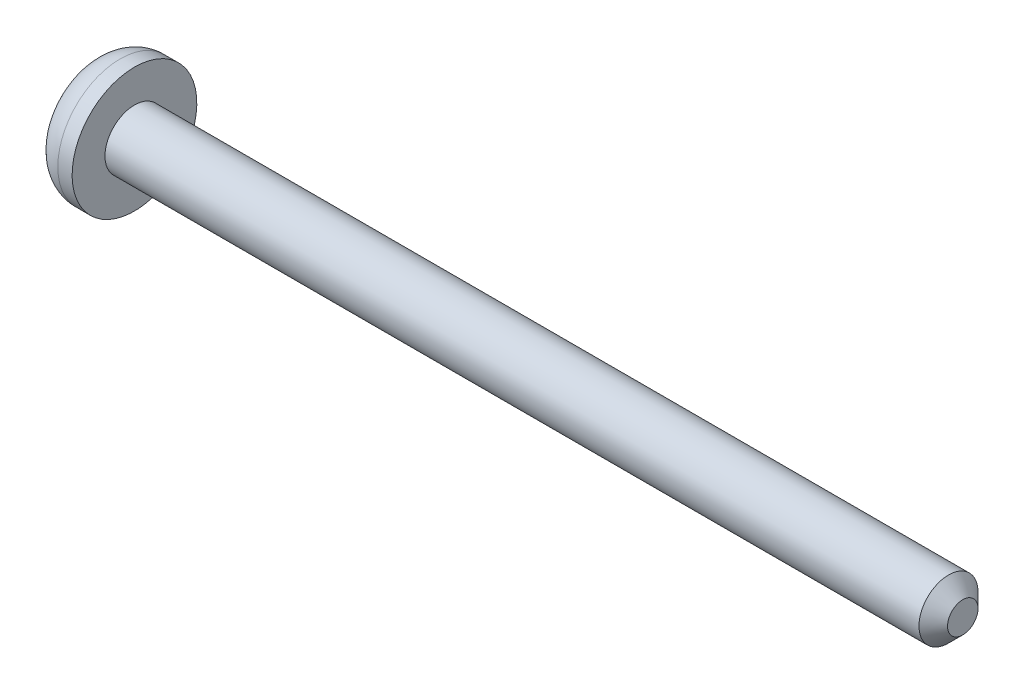
ISO-10303-21;
HEADER;
FILE_DESCRIPTION(('STEP AP214'),'2;1');
FILE_NAME('part.step','',(''),(''),'','','');
FILE_SCHEMA(('AUTOMOTIVE_DESIGN { 1 0 10303 214 1 1 1 1 }'));
ENDSEC;
DATA;
#1=APPLICATION_CONTEXT('core data for automotive mechanical design processes');
#2=APPLICATION_PROTOCOL_DEFINITION('international standard','automotive_design',2000,#1);
#3=PRODUCT_CONTEXT('',#1,'mechanical');
#4=PRODUCT('Part','Part','',(#3));
#5=PRODUCT_RELATED_PRODUCT_CATEGORY('part','',(#4));
#6=PRODUCT_DEFINITION_FORMATION('','',#4);
#7=PRODUCT_DEFINITION_CONTEXT('part definition',#1,'design');
#8=PRODUCT_DEFINITION('design','',#6,#7);
#9=PRODUCT_DEFINITION_SHAPE('','',#8);
#10=(LENGTH_UNIT() NAMED_UNIT(*) SI_UNIT(.MILLI.,.METRE.));
#11=(NAMED_UNIT(*) PLANE_ANGLE_UNIT() SI_UNIT($,.RADIAN.));
#12=(NAMED_UNIT(*) SI_UNIT($,.STERADIAN.) SOLID_ANGLE_UNIT());
#13=UNCERTAINTY_MEASURE_WITH_UNIT(LENGTH_MEASURE(1.E-05),#10,'distance_accuracy_value','');
#14=(GEOMETRIC_REPRESENTATION_CONTEXT(3) GLOBAL_UNCERTAINTY_ASSIGNED_CONTEXT((#13)) GLOBAL_UNIT_ASSIGNED_CONTEXT((#10,
#11,#12)) REPRESENTATION_CONTEXT('',''));
#15=CARTESIAN_POINT('',(0.,0.,0.));
#16=DIRECTION('',(0.,0.,1.));
#17=DIRECTION('',(1.,0.,0.));
#18=AXIS2_PLACEMENT_3D('',#15,#16,#17);
#19=CARTESIAN_POINT('',(-46.482,0.,0.));
#20=DIRECTION('',(-1.,0.,0.));
#21=DIRECTION('',(0.,-0.999999999999997,0.));
#22=AXIS2_PLACEMENT_3D('',#19,#20,#21);
#23=PLANE('',#22);
#24=DIRECTION('',(0.,0.,0.999999999999999));
#25=VECTOR('',#24,1.);
#26=CARTESIAN_POINT('',(-46.482,-0.292769296203976,-0.292769296203851));
#27=LINE('',#26,#25);
#28=CARTESIAN_POINT('',(-46.482,-0.292769296203962,-1.77947680490641));
#29=VERTEX_POINT('',#28);
#30=CARTESIAN_POINT('',(-46.482,-0.292769296203976,-0.292769296203851));
#31=VERTEX_POINT('',#30);
#32=EDGE_CURVE('E206',#29,#31,#27,.T.);
#33=ORIENTED_EDGE('',*,*,#32,.F.);
#34=CARTESIAN_POINT('',(-46.482,0.,0.));
#35=DIRECTION('',(-1.,0.,0.));
#36=DIRECTION('',(0.,-0.999999999999997,0.));
#37=AXIS2_PLACEMENT_3D('',#34,#35,#36);
#38=CIRCLE('',#37,1.8034);
#39=CARTESIAN_POINT('',(-46.482,-1.77947680490662,-0.292769296203838));
#40=VERTEX_POINT('',#39);
#41=EDGE_CURVE('E309',#29,#40,#38,.T.);
#42=ORIENTED_EDGE('',*,*,#41,.T.);
#43=DIRECTION('',(0.,-0.999999999999998,0.));
#44=VECTOR('',#43,1.);
#45=CARTESIAN_POINT('',(-46.482,-2.30304349245305,-0.292769296203851));
#46=LINE('',#45,#44);
#47=EDGE_CURVE('E211',#31,#40,#46,.T.);
#48=ORIENTED_EDGE('',*,*,#47,.F.);
#49=EDGE_LOOP('',(#33,#42,#48));
#50=FACE_BOUND('',#49,.T.);
#51=ADVANCED_FACE('F57',(#50),#23,.T.);
#52=DIRECTION('',(0.,0.999999999999998,0.));
#53=VECTOR('',#52,1.);
#54=CARTESIAN_POINT('',(-46.482,-2.30304349245305,0.292769296203949));
#55=LINE('',#54,#53);
#56=CARTESIAN_POINT('',(-46.482,-1.77947680490658,0.292769296203872));
#57=VERTEX_POINT('',#56);
#58=CARTESIAN_POINT('',(-46.482,-0.292769296203928,0.292769296203865));
#59=VERTEX_POINT('',#58);
#60=EDGE_CURVE('E217',#57,#59,#55,.T.);
#61=ORIENTED_EDGE('',*,*,#60,.F.);
#62=CARTESIAN_POINT('',(-46.482,0.,0.));
#63=DIRECTION('',(-1.,0.,0.));
#64=DIRECTION('',(0.,-0.999999999999997,0.));
#65=AXIS2_PLACEMENT_3D('',#62,#63,#64);
#66=CIRCLE('',#65,1.8034);
#67=CARTESIAN_POINT('',(-46.482,-0.292769296203907,1.77947680490649));
#68=VERTEX_POINT('',#67);
#69=EDGE_CURVE('E306',#57,#68,#66,.T.);
#70=ORIENTED_EDGE('',*,*,#69,.T.);
#71=DIRECTION('',(0.,0.,0.999999999999999));
#72=VECTOR('',#71,1.);
#73=CARTESIAN_POINT('',(-46.482,-0.292769296203949,2.30304349245294));
#74=LINE('',#73,#72);
#75=EDGE_CURVE('E220',#59,#68,#74,.T.);
#76=ORIENTED_EDGE('',*,*,#75,.F.);
#77=EDGE_LOOP('',(#61,#70,#76));
#78=FACE_BOUND('',#77,.T.);
#79=ADVANCED_FACE('F428',(#78),#23,.T.);
#80=DIRECTION('',(0.,0.,-0.999999999999999));
#81=VECTOR('',#80,1.);
#82=CARTESIAN_POINT('',(-46.482,0.292769296203817,2.30304349245301));
#83=LINE('',#82,#81);
#84=CARTESIAN_POINT('',(-46.482,0.292769296203831,1.77947680490659));
#85=VERTEX_POINT('',#84);
#86=CARTESIAN_POINT('',(-46.482,0.292769296203817,0.292769296203851));
#87=VERTEX_POINT('',#86);
#88=EDGE_CURVE('E224',#85,#87,#83,.T.);
#89=ORIENTED_EDGE('',*,*,#88,.F.);
#90=CARTESIAN_POINT('',(-46.482,0.,0.));
#91=DIRECTION('',(-1.,0.,0.));
#92=DIRECTION('',(0.,-0.999999999999997,0.));
#93=AXIS2_PLACEMENT_3D('',#90,#91,#92);
#94=CIRCLE('',#93,1.8034);
#95=CARTESIAN_POINT('',(-46.482,1.77947680490637,0.29276929620399));
#96=VERTEX_POINT('',#95);
#97=EDGE_CURVE('E303',#85,#96,#94,.T.);
#98=ORIENTED_EDGE('',*,*,#97,.T.);
#99=DIRECTION('',(0.,0.999999999999998,0.));
#100=VECTOR('',#99,1.);
#101=CARTESIAN_POINT('',(-46.482,0.292769296203817,0.292769296203851));
#102=LINE('',#101,#100);
#103=EDGE_CURVE('E227',#87,#96,#102,.T.);
#104=ORIENTED_EDGE('',*,*,#103,.F.);
#105=EDGE_LOOP('',(#89,#98,#104));
#106=FACE_BOUND('',#105,.T.);
#107=ADVANCED_FACE('F433',(#106),#23,.T.);
#108=CARTESIAN_POINT('',(0.,0.,0.));
#109=DIRECTION('',(1.,0.,0.));
#110=DIRECTION('',(0.,0.999999999999997,0.));
#111=AXIS2_PLACEMENT_3D('',#108,#109,#110);
#112=PLANE('',#111);
#113=CARTESIAN_POINT('',(0.,0.,0.));
#114=DIRECTION('',(1.,0.,0.));
#115=DIRECTION('',(0.,0.999999999999997,0.));
#116=AXIS2_PLACEMENT_3D('',#113,#114,#115);
#117=CIRCLE('',#116,0.812799999999999);
#118=CARTESIAN_POINT('',(0.,0.812799999999997,0.));
#119=VERTEX_POINT('',#118);
#120=EDGE_CURVE('E293',#119,#119,#117,.T.);
#121=ORIENTED_EDGE('',*,*,#120,.T.);
#122=EDGE_LOOP('',(#121));
#123=FACE_BOUND('',#122,.T.);
#124=ADVANCED_FACE('F444',(#123),#112,.T.);
#125=CARTESIAN_POINT('',(0.,0.,0.));
#126=DIRECTION('',(-1.,0.,0.));
#127=DIRECTION('',(0.,-0.999999999999997,0.));
#128=AXIS2_PLACEMENT_3D('',#125,#126,#127);
#129=CONICAL_SURFACE('',#128,0.812799999999999,0.785398163397449);
#130=CARTESIAN_POINT('',(-0.762000000000013,0.,0.));
#131=DIRECTION('',(1.,0.,0.));
#132=DIRECTION('',(0.,0.999999999999997,0.));
#133=AXIS2_PLACEMENT_3D('',#130,#131,#132);
#134=CIRCLE('',#133,1.5748);
#135=CARTESIAN_POINT('',(-0.762000000000012,1.57479999999995,0.));
#136=VERTEX_POINT('',#135);
#137=EDGE_CURVE('E289',#136,#136,#134,.T.);
#138=ORIENTED_EDGE('',*,*,#137,.T.);
#139=EDGE_LOOP('',(#138));
#140=FACE_BOUND('',#139,.T.);
#141=ORIENTED_EDGE('',*,*,#120,.F.);
#142=EDGE_LOOP('',(#141));
#143=FACE_BOUND('',#142,.T.);
#144=ADVANCED_FACE('F449',(#140,#143),#129,.T.);
#145=CARTESIAN_POINT('',(0.,0.,0.));
#146=DIRECTION('',(1.,0.,0.));
#147=DIRECTION('',(0.,0.999999999999997,0.));
#148=AXIS2_PLACEMENT_3D('',#145,#146,#147);
#149=CYLINDRICAL_SURFACE('',#148,1.5748);
#150=CARTESIAN_POINT('',(-44.196,0.,0.));
#151=DIRECTION('',(1.,0.,0.));
#152=DIRECTION('',(0.,0.999999999999997,0.));
#153=AXIS2_PLACEMENT_3D('',#150,#151,#152);
#154=CIRCLE('',#153,1.5748);
#155=CARTESIAN_POINT('',(-44.196,1.57479999999995,0.));
#156=VERTEX_POINT('',#155);
#157=EDGE_CURVE('E285',#156,#156,#154,.T.);
#158=ORIENTED_EDGE('',*,*,#157,.T.);
#159=EDGE_LOOP('',(#158));
#160=FACE_BOUND('',#159,.T.);
#161=ORIENTED_EDGE('',*,*,#137,.F.);
#162=EDGE_LOOP('',(#161));
#163=FACE_BOUND('',#162,.T.);
#164=ADVANCED_FACE('F529',(#160,#163),#149,.T.);
#165=CARTESIAN_POINT('',(-44.196,1.57479999999987,0.));
#166=DIRECTION('',(1.,0.,0.));
#167=DIRECTION('',(0.,0.999999999999997,0.));
#168=AXIS2_PLACEMENT_3D('',#165,#166,#167);
#169=PLANE('',#168);
#170=CARTESIAN_POINT('',(-44.196,0.,0.));
#171=DIRECTION('',(1.,0.,0.));
#172=DIRECTION('',(0.,0.999999999999997,0.));
#173=AXIS2_PLACEMENT_3D('',#170,#171,#172);
#174=CIRCLE('',#173,3.3274);
#175=CARTESIAN_POINT('',(-44.196,3.32739999999995,0.));
#176=VERTEX_POINT('',#175);
#177=EDGE_CURVE('E281',#176,#176,#174,.T.);
#178=ORIENTED_EDGE('',*,*,#177,.T.);
#179=EDGE_LOOP('',(#178));
#180=FACE_BOUND('',#179,.T.);
#181=ORIENTED_EDGE('',*,*,#157,.F.);
#182=EDGE_LOOP('',(#181));
#183=FACE_BOUND('',#182,.T.);
#184=ADVANCED_FACE('F441',(#180,#183),#169,.T.);
#185=CARTESIAN_POINT('',(0.,0.,0.));
#186=DIRECTION('',(1.,0.,0.));
#187=DIRECTION('',(0.,0.999999999999997,0.));
#188=AXIS2_PLACEMENT_3D('',#185,#186,#187);
#189=CYLINDRICAL_SURFACE('',#188,3.3274);
#190=CARTESIAN_POINT('',(-44.958,-1.04083408558608E-13,0.));
#191=DIRECTION('',(-1.,0.,0.));
#192=DIRECTION('',(0.,-0.999999999999997,0.));
#193=AXIS2_PLACEMENT_3D('',#190,#191,#192);
#194=CIRCLE('',#193,3.3274);
#195=CARTESIAN_POINT('',(-44.958,-3.32740000000009,0.));
#196=VERTEX_POINT('',#195);
#197=EDGE_CURVE('E297',#196,#196,#194,.F.);
#198=ORIENTED_EDGE('',*,*,#197,.T.);
#199=EDGE_LOOP('',(#198));
#200=FACE_BOUND('',#199,.T.);
#201=ORIENTED_EDGE('',*,*,#177,.F.);
#202=EDGE_LOOP('',(#201));
#203=FACE_BOUND('',#202,.T.);
#204=ADVANCED_FACE('F437',(#200,#203),#189,.T.);
#205=DIRECTION('',(0.,-0.999999999999998,0.));
#206=VECTOR('',#205,1.);
#207=CARTESIAN_POINT('',(-46.482,0.292769296203817,-0.292769296203907));
#208=LINE('',#207,#206);
#209=CARTESIAN_POINT('',(-46.482,1.77947680490643,-0.292769296203865));
#210=VERTEX_POINT('',#209);
#211=CARTESIAN_POINT('',(-46.482,0.292769296203817,-0.292769296203907));
#212=VERTEX_POINT('',#211);
#213=EDGE_CURVE('E181',#210,#212,#208,.T.);
#214=ORIENTED_EDGE('',*,*,#213,.F.);
#215=CARTESIAN_POINT('',(-46.482,0.,0.));
#216=DIRECTION('',(-1.,0.,0.));
#217=DIRECTION('',(0.,-0.999999999999997,0.));
#218=AXIS2_PLACEMENT_3D('',#215,#216,#217);
#219=CIRCLE('',#218,1.8034);
#220=CARTESIAN_POINT('',(-46.482,0.292769296203844,-1.77947680490649));
#221=VERTEX_POINT('',#220);
#222=EDGE_CURVE('E204',#210,#221,#219,.T.);
#223=ORIENTED_EDGE('',*,*,#222,.T.);
#224=DIRECTION('',(0.,0.,-0.999999999999999));
#225=VECTOR('',#224,1.);
#226=CARTESIAN_POINT('',(-46.482,0.292769296203817,-0.292769296203907));
#227=LINE('',#226,#225);
#228=EDGE_CURVE('E193',#212,#221,#227,.T.);
#229=ORIENTED_EDGE('',*,*,#228,.F.);
#230=EDGE_LOOP('',(#214,#223,#229));
#231=FACE_BOUND('',#230,.T.);
#232=ADVANCED_FACE('F203',(#231),#23,.T.);
#233=CARTESIAN_POINT('',(-46.482,2.30304349245287,-0.292769296203747));
#234=DIRECTION('',(0.559192903470748,0.82903757255504,0.));
#235=DIRECTION('',(-0.829037572555042,0.559192903470745,0.));
#236=AXIS2_PLACEMENT_3D('',#233,#234,#235);
#237=PLANE('',#236);
#238=DIRECTION('',(-0.723589100218007,0.488067010791393,0.488067010791395));
#239=VECTOR('',#238,1.);
#240=CARTESIAN_POINT('',(-45.7720516268,1.82417726821109,-0.186096928038004));
#241=LINE('',#240,#239);
#242=CARTESIAN_POINT('',(-46.0479516686692,2.010274196249,0.));
#243=VERTEX_POINT('',#242);
#244=CARTESIAN_POINT('',(-46.4096462258619,2.25424025557103,0.243966059321976));
#245=VERTEX_POINT('',#244);
#246=EDGE_CURVE('E230',#243,#245,#241,.T.);
#247=ORIENTED_EDGE('',*,*,#246,.T.);
#248=CARTESIAN_POINT('',(-46.4096462258619,2.25424025557103,0.243966059321976));
#249=CARTESIAN_POINT('',(-46.4119292562582,2.25578017901754,0.162644039547985));
#250=CARTESIAN_POINT('',(-46.4130707714564,2.2565501407408,0.0813220197739943));
#251=CARTESIAN_POINT('',(-46.4130707714563,2.25655014074082,-0.0813220197739875));
#252=CARTESIAN_POINT('',(-46.4119292562582,2.25578017901757,-0.162644039547978));
#253=CARTESIAN_POINT('',(-46.4096462258618,2.25424025557107,-0.243966059321969));
#254=B_SPLINE_CURVE_WITH_KNOTS('',3,(#248,#249,#250,#251,#252,#253),.UNSPECIFIED.,.F.,.F.,(4,2,
4),(0.,0.244001027012426,0.488002054024852),.UNSPECIFIED.);
#255=CARTESIAN_POINT('',(-46.4096462258618,2.25424025557107,-0.243966059321969));
#256=VERTEX_POINT('',#255);
#257=EDGE_CURVE('E392',#245,#256,#254,.T.);
#258=ORIENTED_EDGE('',*,*,#257,.T.);
#259=DIRECTION('',(-0.723589100218006,0.488067010791393,-0.488067010791394));
#260=VECTOR('',#259,1.);
#261=CARTESIAN_POINT('',(-46.482,2.30304349245287,-0.292769296203747));
#262=LINE('',#261,#260);
#263=EDGE_CURVE('E201',#243,#256,#262,.T.);
#264=ORIENTED_EDGE('',*,*,#263,.F.);
#265=EDGE_LOOP('',(#247,#258,#264));
#266=FACE_BOUND('',#265,.T.);
#267=ADVANCED_FACE('F383',(#266),#237,.F.);
#268=CARTESIAN_POINT('',(-46.482,0.292769296203817,0.292769296203851));
#269=DIRECTION('',(0.559192903470747,0.,0.829037572555041));
#270=DIRECTION('',(0.829037572555043,0.,-0.559192903470747));
#271=AXIS2_PLACEMENT_3D('',#268,#269,#270);
#272=PLANE('',#271);
#273=ORIENTED_EDGE('',*,*,#103,.T.);
#274=CARTESIAN_POINT('',(-46.482,1.77947680490637,0.29276929620399));
#275=CARTESIAN_POINT('',(-46.4820042606114,1.82008658589525,0.292772170022564));
#276=CARTESIAN_POINT('',(-46.4804197500243,1.86068760080097,0.291703404136539));
#277=CARTESIAN_POINT('',(-46.4741973200969,1.94122298601125,0.287506322154994));
#278=CARTESIAN_POINT('',(-46.4695838012315,1.98116009022815,0.284394464387663));
#279=CARTESIAN_POINT('',(-46.4574241907559,2.06037544254997,0.276192703560412));
#280=CARTESIAN_POINT('',(-46.4498780851341,2.09965368750598,0.271102791049512));
#281=CARTESIAN_POINT('',(-46.4319060779803,2.17758056686513,0.25898051915949));
#282=CARTESIAN_POINT('',(-46.4214575587379,2.21622162214997,0.251932903942143));
#283=CARTESIAN_POINT('',(-46.4096462258619,2.25424025557103,0.243966059321976));
#284=B_SPLINE_CURVE_WITH_KNOTS('',3,(#274,#275,#276,#277,#278,#279,#280,#281,#282,#283),
.UNSPECIFIED.,.F.,.F.,(4,2,2,2,4),(0.,0.121771620392056,0.242574138662809,0.363377234125002,
0.485149482000903),.UNSPECIFIED.);
#285=EDGE_CURVE('E386',#96,#245,#284,.T.);
#286=ORIENTED_EDGE('',*,*,#285,.T.);
#287=ORIENTED_EDGE('',*,*,#246,.F.);
#288=DIRECTION('',(0.,-0.999999999999998,0.));
#289=VECTOR('',#288,1.);
#290=CARTESIAN_POINT('',(-46.0479516686692,0.292769296203803,0.));
#291=LINE('',#290,#289);
#292=CARTESIAN_POINT('',(-46.0479516686692,0.,0.));
#293=VERTEX_POINT('',#292);
#294=EDGE_CURVE('E278',#243,#293,#291,.T.);
#295=ORIENTED_EDGE('',*,*,#294,.T.);
#296=DIRECTION('',(-0.723589100218007,0.488067010791393,0.488067010791395));
#297=VECTOR('',#296,1.);
#298=CARTESIAN_POINT('',(-46.482,0.292769296203817,0.292769296203851));
#299=LINE('',#298,#297);
#300=EDGE_CURVE('E235',#293,#87,#299,.T.);
#301=ORIENTED_EDGE('',*,*,#300,.T.);
#302=EDGE_LOOP('',(#273,#286,#287,#295,#301));
#303=FACE_BOUND('',#302,.T.);
#304=ADVANCED_FACE('F378',(#303),#272,.F.);
#305=CARTESIAN_POINT('',(-46.482,0.292769296203817,2.30304349245301));
#306=DIRECTION('',(0.559192903470748,0.829037572555039,0.));
#307=DIRECTION('',(-0.829037572555042,0.559192903470745,0.));
#308=AXIS2_PLACEMENT_3D('',#305,#306,#307);
#309=PLANE('',#308);
#310=DIRECTION('',(-0.723589100218007,0.488067010791393,0.488067010791395));
#311=VECTOR('',#310,1.);
#312=CARTESIAN_POINT('',(-46.482,0.292769296203817,2.30304349245301));
#313=LINE('',#312,#311);
#314=CARTESIAN_POINT('',(-46.0479516686692,0.,2.01027419624911));
#315=VERTEX_POINT('',#314);
#316=CARTESIAN_POINT('',(-46.4096462258618,0.243966059321886,2.25424025557112));
#317=VERTEX_POINT('',#316);
#318=EDGE_CURVE('E263',#315,#317,#313,.T.);
#319=ORIENTED_EDGE('',*,*,#318,.T.);
#320=CARTESIAN_POINT('',(-46.4096462258618,0.243966059321886,2.25424025557112));
#321=CARTESIAN_POINT('',(-46.4214575587379,0.25193290394209,2.21622162215009));
#322=CARTESIAN_POINT('',(-46.4319060779802,0.258980519159448,2.17758056686526));
#323=CARTESIAN_POINT('',(-46.4498780851341,0.271102791049476,2.09965368750613));
#324=CARTESIAN_POINT('',(-46.4574241907559,0.27619270356037,2.06037544255013));
#325=CARTESIAN_POINT('',(-46.4695838012315,0.284394464387624,1.98116009022833));
#326=CARTESIAN_POINT('',(-46.4741973200969,0.287506322154965,1.94122298601143));
#327=CARTESIAN_POINT('',(-46.4804197500243,0.291703404136489,1.86068760080117));
#328=CARTESIAN_POINT('',(-46.4820042606114,0.292772170022484,1.82008658589546));
#329=CARTESIAN_POINT('',(-46.482,0.292769296203831,1.77947680490659));
#330=B_SPLINE_CURVE_WITH_KNOTS('',3,(#320,#321,#322,#323,#324,#325,#326,#327,#328,#329),
.UNSPECIFIED.,.F.,.F.,(4,2,2,2,4),(0.,0.121772247875879,0.242575343338046,0.363377861608772,
0.485149482000806),.UNSPECIFIED.);
#331=EDGE_CURVE('E364',#317,#85,#330,.T.);
#332=ORIENTED_EDGE('',*,*,#331,.T.);
#333=ORIENTED_EDGE('',*,*,#88,.T.);
#334=ORIENTED_EDGE('',*,*,#300,.F.);
#335=DIRECTION('',(0.,0.,-0.999999999999999));
#336=VECTOR('',#335,1.);
#337=CARTESIAN_POINT('',(-46.0479516686692,0.,2.30304349245297));
#338=LINE('',#337,#336);
#339=EDGE_CURVE('E234',#315,#293,#338,.T.);
#340=ORIENTED_EDGE('',*,*,#339,.F.);
#341=EDGE_LOOP('',(#319,#332,#333,#334,#340));
#342=FACE_BOUND('',#341,.T.);
#343=ADVANCED_FACE('F373',(#342),#309,.F.);
#344=CARTESIAN_POINT('',(-46.482,0.292769296203817,2.30304349245301));
#345=DIRECTION('',(0.559192903470747,0.,0.829037572555041));
#346=DIRECTION('',(0.829037572555043,0.,-0.559192903470747));
#347=AXIS2_PLACEMENT_3D('',#344,#345,#346);
#348=PLANE('',#347);
#349=DIRECTION('',(-0.723589100218009,-0.488067010791393,0.488067010791394));
#350=VECTOR('',#349,1.);
#351=CARTESIAN_POINT('',(-46.482,-0.292769296203949,2.30304349245294));
#352=LINE('',#351,#350);
#353=CARTESIAN_POINT('',(-46.4096462258618,-0.243966059322066,2.25424025557108));
#354=VERTEX_POINT('',#353);
#355=EDGE_CURVE('E259',#315,#354,#352,.T.);
#356=ORIENTED_EDGE('',*,*,#355,.T.);
#357=CARTESIAN_POINT('',(-46.4096462258618,-0.243966059322066,2.25424025557108));
#358=CARTESIAN_POINT('',(-46.4119292562582,-0.162644039548074,2.25578017901765));
#359=CARTESIAN_POINT('',(-46.4130707714564,-0.0813220197740823,2.25655014074094));
#360=CARTESIAN_POINT('',(-46.4130707714564,0.0813220197739018,2.25655014074095));
#361=CARTESIAN_POINT('',(-46.4119292562582,0.162644039547894,2.25578017901768));
#362=CARTESIAN_POINT('',(-46.4096462258618,0.243966059321886,2.25424025557112));
#363=B_SPLINE_CURVE_WITH_KNOTS('',3,(#357,#358,#359,#360,#361,#362),.UNSPECIFIED.,.F.,.F.,(4,2,
4),(0.,0.244001027012431,0.488002054024861),.UNSPECIFIED.);
#364=EDGE_CURVE('E358',#354,#317,#363,.T.);
#365=ORIENTED_EDGE('',*,*,#364,.T.);
#366=ORIENTED_EDGE('',*,*,#318,.F.);
#367=EDGE_LOOP('',(#356,#365,#366));
#368=FACE_BOUND('',#367,.T.);
#369=ADVANCED_FACE('F370',(#368),#348,.F.);
#370=CARTESIAN_POINT('',(-46.482,-0.292769296203949,2.30304349245294));
#371=DIRECTION('',(0.559192903470747,-0.829037572555038,0.));
#372=DIRECTION('',(0.829037572555042,0.559192903470747,0.));
#373=AXIS2_PLACEMENT_3D('',#370,#371,#372);
#374=PLANE('',#373);
#375=ORIENTED_EDGE('',*,*,#75,.T.);
#376=CARTESIAN_POINT('',(-46.482,-0.292769296203907,1.77947680490649));
#377=CARTESIAN_POINT('',(-46.4820042606114,-0.292772170022596,1.82008658589536));
#378=CARTESIAN_POINT('',(-46.4804197500243,-0.291703404136619,1.86068760080108));
#379=CARTESIAN_POINT('',(-46.4741973200969,-0.287506322155109,1.94122298601135));
#380=CARTESIAN_POINT('',(-46.4695838012315,-0.284394464387766,1.98116009022825));
#381=CARTESIAN_POINT('',(-46.4574241907559,-0.276192703560508,2.06037544255006));
#382=CARTESIAN_POINT('',(-46.4498780851341,-0.271102791049613,2.09965368750607));
#383=CARTESIAN_POINT('',(-46.4319060779803,-0.258980519159595,2.17758056686521));
#384=CARTESIAN_POINT('',(-46.4214575587379,-0.251932903942247,2.21622162215004));
#385=CARTESIAN_POINT('',(-46.4096462258618,-0.243966059322066,2.25424025557108));
#386=B_SPLINE_CURVE_WITH_KNOTS('',3,(#376,#377,#378,#379,#380,#381,#382,#383,#384,#385),
.UNSPECIFIED.,.F.,.F.,(4,2,2,2,4),(0.,0.121771620392046,0.242574138662785,0.363377234124964,
0.485149482000856),.UNSPECIFIED.);
#387=EDGE_CURVE('E352',#68,#354,#386,.T.);
#388=ORIENTED_EDGE('',*,*,#387,.T.);
#389=ORIENTED_EDGE('',*,*,#355,.F.);
#390=ORIENTED_EDGE('',*,*,#339,.T.);
#391=DIRECTION('',(-0.723589100218009,-0.488067010791393,0.488067010791394));
#392=VECTOR('',#391,1.);
#393=CARTESIAN_POINT('',(-47.1919483732,-0.771635520445763,0.771635520445679));
#394=LINE('',#393,#392);
#395=EDGE_CURVE('E255',#293,#59,#394,.T.);
#396=ORIENTED_EDGE('',*,*,#395,.T.);
#397=EDGE_LOOP('',(#375,#388,#389,#390,#396));
#398=FACE_BOUND('',#397,.T.);
#399=ADVANCED_FACE('F342',(#398),#374,.F.);
#400=CARTESIAN_POINT('',(-46.482,-2.30304349245305,0.292769296203949));
#401=DIRECTION('',(0.559192903470747,0.,0.829037572555041));
#402=DIRECTION('',(0.829037572555043,0.,-0.559192903470747));
#403=AXIS2_PLACEMENT_3D('',#400,#401,#402);
#404=PLANE('',#403);
#405=DIRECTION('',(-0.723589100218009,-0.488067010791393,0.488067010791394));
#406=VECTOR('',#405,1.);
#407=CARTESIAN_POINT('',(-46.2752112087489,-2.16356269156659,0.15328849531749));
#408=LINE('',#407,#406);
#409=CARTESIAN_POINT('',(-46.0479516686692,-2.01027419624921,0.));
#410=VERTEX_POINT('',#409);
#411=CARTESIAN_POINT('',(-46.4096462258619,-2.25424025557114,0.243966059322059));
#412=VERTEX_POINT('',#411);
#413=EDGE_CURVE('E251',#410,#412,#408,.T.);
#414=ORIENTED_EDGE('',*,*,#413,.T.);
#415=CARTESIAN_POINT('',(-46.4096462258619,-2.25424025557114,0.243966059322059));
#416=CARTESIAN_POINT('',(-46.4214575587379,-2.21622162215009,0.251932903942247));
#417=CARTESIAN_POINT('',(-46.4319060779803,-2.17758056686526,0.258980519159596));
#418=CARTESIAN_POINT('',(-46.4498780851341,-2.09965368750613,0.271102791049614));
#419=CARTESIAN_POINT('',(-46.4574241907559,-2.06037544255013,0.276192703560508));
#420=CARTESIAN_POINT('',(-46.4695838012315,-1.98116009022832,0.284394464387766));
#421=CARTESIAN_POINT('',(-46.4741973200969,-1.94122298601143,0.287506322155111));
#422=CARTESIAN_POINT('',(-46.4804197500243,-1.86068760080117,0.291703404136615));
#423=CARTESIAN_POINT('',(-46.4820042606114,-1.82008658589545,0.292772170022583));
#424=CARTESIAN_POINT('',(-46.482,-1.77947680490658,0.292769296203872));
#425=B_SPLINE_CURVE_WITH_KNOTS('',3,(#415,#416,#417,#418,#419,#420,#421,#422,#423,#424),
.UNSPECIFIED.,.F.,.F.,(4,2,2,2,4),(0.,0.121772247875876,0.242575343338043,0.363377861608773,
0.485149482000808),.UNSPECIFIED.);
#426=EDGE_CURVE('E346',#412,#57,#425,.T.);
#427=ORIENTED_EDGE('',*,*,#426,.T.);
#428=ORIENTED_EDGE('',*,*,#60,.T.);
#429=ORIENTED_EDGE('',*,*,#395,.F.);
#430=DIRECTION('',(0.,0.999999999999998,0.));
#431=VECTOR('',#430,1.);
#432=CARTESIAN_POINT('',(-46.0479516686692,-2.30304349245299,0.));
#433=LINE('',#432,#431);
#434=EDGE_CURVE('E272',#410,#293,#433,.T.);
#435=ORIENTED_EDGE('',*,*,#434,.F.);
#436=EDGE_LOOP('',(#414,#427,#428,#429,#435));
#437=FACE_BOUND('',#436,.T.);
#438=ADVANCED_FACE('F337',(#437),#404,.F.);
#439=CARTESIAN_POINT('',(-46.482,-2.30304349245305,-0.292769296203851));
#440=DIRECTION('',(0.559192903470747,-0.829037572555038,0.));
#441=DIRECTION('',(0.829037572555042,0.559192903470747,0.));
#442=AXIS2_PLACEMENT_3D('',#439,#440,#441);
#443=PLANE('',#442);
#444=DIRECTION('',(-0.723589100218009,-0.488067010791394,-0.488067010791395));
#445=VECTOR('',#444,1.);
#446=CARTESIAN_POINT('',(-46.482,-2.30304349245305,-0.292769296203851));
#447=LINE('',#446,#445);
#448=CARTESIAN_POINT('',(-46.4096462258619,-2.25424025557108,-0.243966059321997));
#449=VERTEX_POINT('',#448);
#450=EDGE_CURVE('E247',#410,#449,#447,.T.);
#451=ORIENTED_EDGE('',*,*,#450,.T.);
#452=CARTESIAN_POINT('',(-46.4096462258619,-2.25424025557108,-0.243966059321997));
#453=CARTESIAN_POINT('',(-46.4119292562582,-2.25578017901768,-0.162644039547988));
#454=CARTESIAN_POINT('',(-46.4130707714564,-2.25655014074098,-0.0813220197739783));
#455=CARTESIAN_POINT('',(-46.4130707714564,-2.256550140741,0.0813220197740405));
#456=CARTESIAN_POINT('',(-46.4119292562582,-2.25578017901772,0.16264403954805));
#457=CARTESIAN_POINT('',(-46.4096462258619,-2.25424025557114,0.243966059322059));
#458=B_SPLINE_CURVE_WITH_KNOTS('',3,(#452,#453,#454,#455,#456,#457),.UNSPECIFIED.,.F.,.F.,(4,2,
4),(0.,0.244001027012482,0.488002054024964),.UNSPECIFIED.);
#459=EDGE_CURVE('E320',#449,#412,#458,.T.);
#460=ORIENTED_EDGE('',*,*,#459,.T.);
#461=ORIENTED_EDGE('',*,*,#413,.F.);
#462=EDGE_LOOP('',(#451,#460,#461));
#463=FACE_BOUND('',#462,.T.);
#464=ADVANCED_FACE('F330',(#463),#443,.F.);
#465=CARTESIAN_POINT('',(-46.482,-2.30304349245305,-0.292769296203851));
#466=DIRECTION('',(0.559192903470748,0.,-0.829037572555041));
#467=DIRECTION('',(-0.829037572555042,0.,-0.559192903470746));
#468=AXIS2_PLACEMENT_3D('',#465,#466,#467);
#469=PLANE('',#468);
#470=ORIENTED_EDGE('',*,*,#47,.T.);
#471=CARTESIAN_POINT('',(-46.482,-1.77947680490662,-0.292769296203838));
#472=CARTESIAN_POINT('',(-46.4820042606114,-1.82008658589548,-0.292772170022508));
#473=CARTESIAN_POINT('',(-46.4804197500243,-1.86068760080119,-0.291703404136523));
#474=CARTESIAN_POINT('',(-46.4741973200969,-1.94122298601143,-0.287506322155008));
#475=CARTESIAN_POINT('',(-46.4695838012315,-1.98116009022832,-0.284394464387669));
#476=CARTESIAN_POINT('',(-46.4574241907559,-2.06037544255011,-0.276192703560415));
#477=CARTESIAN_POINT('',(-46.4498780851341,-2.0996536875061,-0.271102791049521));
#478=CARTESIAN_POINT('',(-46.4319060779803,-2.17758056686522,-0.258980519159509));
#479=CARTESIAN_POINT('',(-46.4214575587379,-2.21622162215004,-0.251932903942167));
#480=CARTESIAN_POINT('',(-46.4096462258619,-2.25424025557108,-0.243966059321997));
#481=B_SPLINE_CURVE_WITH_KNOTS('',3,(#471,#472,#473,#474,#475,#476,#477,#478,#479,#480),
.UNSPECIFIED.,.F.,.F.,(4,2,2,2,4),(0.,0.121771620392011,0.242574138662715,0.363377234124856,
0.485149482000708),.UNSPECIFIED.);
#482=EDGE_CURVE('E313',#40,#449,#481,.T.);
#483=ORIENTED_EDGE('',*,*,#482,.T.);
#484=ORIENTED_EDGE('',*,*,#450,.F.);
#485=ORIENTED_EDGE('',*,*,#434,.T.);
#486=DIRECTION('',(-0.723589100218009,-0.488067010791394,-0.488067010791395));
#487=VECTOR('',#486,1.);
#488=CARTESIAN_POINT('',(-47.1919483732,-0.771635520445776,-0.771635520445686));
#489=LINE('',#488,#487);
#490=EDGE_CURVE('E243',#293,#31,#489,.T.);
#491=ORIENTED_EDGE('',*,*,#490,.T.);
#492=EDGE_LOOP('',(#470,#483,#484,#485,#491));
#493=FACE_BOUND('',#492,.T.);
#494=ADVANCED_FACE('F326',(#493),#469,.F.);
#495=CARTESIAN_POINT('',(-46.482,-0.292769296203976,-0.292769296203851));
#496=DIRECTION('',(0.559192903470748,-0.829037572555038,0.));
#497=DIRECTION('',(0.829037572555042,0.559192903470747,0.));
#498=AXIS2_PLACEMENT_3D('',#495,#496,#497);
#499=PLANE('',#498);
#500=DIRECTION('',(-0.723589100218009,-0.488067010791394,-0.488067010791395));
#501=VECTOR('',#500,1.);
#502=CARTESIAN_POINT('',(-46.2752112087489,-0.153288495317504,-2.16356269156644));
#503=LINE('',#502,#501);
#504=CARTESIAN_POINT('',(-46.0479516686692,0.,-2.01027419624905));
#505=VERTEX_POINT('',#504);
#506=CARTESIAN_POINT('',(-46.4096462258619,-0.243966059322094,-2.25424025557106));
#507=VERTEX_POINT('',#506);
#508=EDGE_CURVE('E240',#505,#507,#503,.T.);
#509=ORIENTED_EDGE('',*,*,#508,.T.);
#510=CARTESIAN_POINT('',(-46.4096462258619,-0.243966059322094,-2.25424025557106));
#511=CARTESIAN_POINT('',(-46.4214575587379,-0.251932903942274,-2.21622162215));
#512=CARTESIAN_POINT('',(-46.4319060779803,-0.258980519159622,-2.17758056686516));
#513=CARTESIAN_POINT('',(-46.4498780851341,-0.271102791049642,-2.09965368750602));
#514=CARTESIAN_POINT('',(-46.4574241907559,-0.276192703560538,-2.06037544255001));
#515=CARTESIAN_POINT('',(-46.4695838012315,-0.284394464387794,-1.98116009022819));
#516=CARTESIAN_POINT('',(-46.4741973200969,-0.287506322155136,-1.94122298601129));
#517=CARTESIAN_POINT('',(-46.4804197500243,-0.291703404136651,-1.86068760080102));
#518=CARTESIAN_POINT('',(-46.4820042606114,-0.292772170022635,-1.82008658589529));
#519=CARTESIAN_POINT('',(-46.482,-0.292769296203962,-1.77947680490641));
#520=B_SPLINE_CURVE_WITH_KNOTS('',3,(#510,#511,#512,#513,#514,#515,#516,#517,#518,#519),
.UNSPECIFIED.,.F.,.F.,(4,2,2,2,4),(0.,0.121772247875897,0.242575343338081,0.363377861608832,
0.485149482000889),.UNSPECIFIED.);
#521=EDGE_CURVE('E13',#507,#29,#520,.T.);
#522=ORIENTED_EDGE('',*,*,#521,.T.);
#523=ORIENTED_EDGE('',*,*,#32,.T.);
#524=ORIENTED_EDGE('',*,*,#490,.F.);
#525=DIRECTION('',(0.,0.,0.999999999999999));
#526=VECTOR('',#525,1.);
#527=CARTESIAN_POINT('',(-46.0479516686692,-1.04083408558608E-13,-0.292769296203817));
#528=LINE('',#527,#526);
#529=EDGE_CURVE('E197',#505,#293,#528,.T.);
#530=ORIENTED_EDGE('',*,*,#529,.F.);
#531=EDGE_LOOP('',(#509,#522,#523,#524,#530));
#532=FACE_BOUND('',#531,.T.);
#533=ADVANCED_FACE('F329',(#532),#499,.F.);
#534=CARTESIAN_POINT('',(-46.482,0.292769296203838,-2.30304349245295));
#535=DIRECTION('',(0.559192903470748,0.,-0.829037572555041));
#536=DIRECTION('',(-0.829037572555042,0.,-0.559192903470746));
#537=AXIS2_PLACEMENT_3D('',#534,#535,#536);
#538=PLANE('',#537);
#539=DIRECTION('',(-0.723589100218006,0.488067010791393,-0.488067010791394));
#540=VECTOR('',#539,1.);
#541=CARTESIAN_POINT('',(-45.7720516268,-0.186096928038046,-1.8241772682111));
#542=LINE('',#541,#540);
#543=CARTESIAN_POINT('',(-46.4096462258619,0.243966059321886,-2.25424025557112));
#544=VERTEX_POINT('',#543);
#545=EDGE_CURVE('E200',#505,#544,#542,.T.);
#546=ORIENTED_EDGE('',*,*,#545,.T.);
#547=CARTESIAN_POINT('',(-46.4096462258619,0.243966059321921,-2.25424025557096));
#548=CARTESIAN_POINT('',(-46.4119292562582,0.162644039547918,-2.25578017901756));
#549=CARTESIAN_POINT('',(-46.4130707714564,0.0813220197739159,-2.25655014074087));
#550=CARTESIAN_POINT('',(-46.4130707714564,-0.081322019774089,-2.2565501407409));
#551=CARTESIAN_POINT('',(-46.4119292562582,-0.162644039548091,-2.25578017901762));
#552=CARTESIAN_POINT('',(-46.4096462258619,-0.243966059322094,-2.25424025557106));
#553=B_SPLINE_CURVE_WITH_KNOTS('',3,(#547,#548,#549,#550,#551,#552),.UNSPECIFIED.,.F.,.F.,(4,2,
4),(0.,0.244001027012462,0.488002054024922),.UNSPECIFIED.);
#554=EDGE_CURVE('E71',#544,#507,#553,.T.);
#555=ORIENTED_EDGE('',*,*,#554,.T.);
#556=ORIENTED_EDGE('',*,*,#508,.F.);
#557=EDGE_LOOP('',(#546,#555,#556));
#558=FACE_BOUND('',#557,.T.);
#559=ADVANCED_FACE('F411',(#558),#538,.F.);
#560=CARTESIAN_POINT('',(-46.482,0.292769296203817,-0.292769296203907));
#561=DIRECTION('',(0.559192903470748,0.829037572555039,0.));
#562=DIRECTION('',(-0.829037572555042,0.559192903470745,0.));
#563=AXIS2_PLACEMENT_3D('',#560,#561,#562);
#564=PLANE('',#563);
#565=ORIENTED_EDGE('',*,*,#228,.T.);
#566=CARTESIAN_POINT('',(-46.482,0.292769296203844,-1.77947680490649));
#567=CARTESIAN_POINT('',(-46.4820042606114,0.29277217002249,-1.82008658589535));
#568=CARTESIAN_POINT('',(-46.4804197500243,0.291703404136493,-1.86068760080106));
#569=CARTESIAN_POINT('',(-46.4741973200969,0.287506322154969,-1.94122298601131));
#570=CARTESIAN_POINT('',(-46.4695838012315,0.284394464387631,-1.9811600902282));
#571=CARTESIAN_POINT('',(-46.4574241907559,0.276192703560381,-2.06037544254999));
#572=CARTESIAN_POINT('',(-46.4498780851341,0.271102791049489,-2.09965368750598));
#573=CARTESIAN_POINT('',(-46.4319060779803,0.258980519159468,-2.1775805668651));
#574=CARTESIAN_POINT('',(-46.4214575587379,0.251932903942115,-2.21622162214992));
#575=CARTESIAN_POINT('',(-46.4096462258619,0.243966059321921,-2.25424025557096));
#576=B_SPLINE_CURVE_WITH_KNOTS('',3,(#566,#567,#568,#569,#570,#571,#572,#573,#574,#575),
.UNSPECIFIED.,.F.,.F.,(4,2,2,2,4),(0.,0.121771620392013,0.24257413866272,0.363377234124866,
0.485149482000722),.UNSPECIFIED.);
#577=EDGE_CURVE('E89',#221,#544,#576,.T.);
#578=ORIENTED_EDGE('',*,*,#577,.T.);
#579=ORIENTED_EDGE('',*,*,#545,.F.);
#580=ORIENTED_EDGE('',*,*,#529,.T.);
#581=DIRECTION('',(-0.723589100218006,0.488067010791393,-0.488067010791394));
#582=VECTOR('',#581,1.);
#583=CARTESIAN_POINT('',(-46.482,0.292769296203817,-0.292769296203907));
#584=LINE('',#583,#582);
#585=EDGE_CURVE('E185',#293,#212,#584,.T.);
#586=ORIENTED_EDGE('',*,*,#585,.T.);
#587=EDGE_LOOP('',(#565,#578,#579,#580,#586));
#588=FACE_BOUND('',#587,.T.);
#589=ADVANCED_FACE('F196',(#588),#564,.F.);
#590=CARTESIAN_POINT('',(-46.482,0.292769296203817,-0.292769296203907));
#591=DIRECTION('',(0.559192903470748,0.,-0.829037572555041));
#592=DIRECTION('',(-0.829037572555042,0.,-0.559192903470746));
#593=AXIS2_PLACEMENT_3D('',#590,#591,#592);
#594=PLANE('',#593);
#595=ORIENTED_EDGE('',*,*,#263,.T.);
#596=CARTESIAN_POINT('',(-46.4096462258618,2.25424025557107,-0.243966059321969));
#597=CARTESIAN_POINT('',(-46.4214575587379,2.21622162215002,-0.251932903942173));
#598=CARTESIAN_POINT('',(-46.4319060779802,2.17758056686519,-0.258980519159531));
#599=CARTESIAN_POINT('',(-46.4498780851341,2.09965368750604,-0.27110279104956));
#600=CARTESIAN_POINT('',(-46.4574241907559,2.06037544255003,-0.276192703560456));
#601=CARTESIAN_POINT('',(-46.4695838012315,1.98116009022821,-0.284394464387716));
#602=CARTESIAN_POINT('',(-46.4741973200969,1.94122298601131,-0.287506322155061));
#603=CARTESIAN_POINT('',(-46.4804197500243,1.86068760080104,-0.291703404136576));
#604=CARTESIAN_POINT('',(-46.4820042606114,1.82008658589531,-0.292772170022555));
#605=CARTESIAN_POINT('',(-46.482,1.77947680490643,-0.292769296203865));
#606=B_SPLINE_CURVE_WITH_KNOTS('',3,(#596,#597,#598,#599,#600,#601,#602,#603,#604,#605),
.UNSPECIFIED.,.F.,.F.,(4,2,2,2,4),(0.,0.121772247875904,0.242575343338092,0.363377861608845,
0.485149482000907),.UNSPECIFIED.);
#607=EDGE_CURVE('E188',#256,#210,#606,.T.);
#608=ORIENTED_EDGE('',*,*,#607,.T.);
#609=ORIENTED_EDGE('',*,*,#213,.T.);
#610=ORIENTED_EDGE('',*,*,#585,.F.);
#611=ORIENTED_EDGE('',*,*,#294,.F.);
#612=EDGE_LOOP('',(#595,#608,#609,#610,#611));
#613=FACE_BOUND('',#612,.T.);
#614=ADVANCED_FACE('F184',(#613),#594,.F.);
#615=CARTESIAN_POINT('',(-44.958,-1.04083408558608E-13,0.));
#616=DIRECTION('',(-1.,0.,0.));
#617=DIRECTION('',(0.,-0.999999999999997,0.));
#618=AXIS2_PLACEMENT_3D('',#615,#616,#617);
#619=TOROIDAL_SURFACE('',#618,1.8034,1.524);
#620=ORIENTED_EDGE('',*,*,#482,.F.);
#621=ORIENTED_EDGE('',*,*,#41,.F.);
#622=ORIENTED_EDGE('',*,*,#521,.F.);
#623=ORIENTED_EDGE('',*,*,#554,.F.);
#624=ORIENTED_EDGE('',*,*,#577,.F.);
#625=ORIENTED_EDGE('',*,*,#222,.F.);
#626=ORIENTED_EDGE('',*,*,#607,.F.);
#627=ORIENTED_EDGE('',*,*,#257,.F.);
#628=ORIENTED_EDGE('',*,*,#285,.F.);
#629=ORIENTED_EDGE('',*,*,#97,.F.);
#630=ORIENTED_EDGE('',*,*,#331,.F.);
#631=ORIENTED_EDGE('',*,*,#364,.F.);
#632=ORIENTED_EDGE('',*,*,#387,.F.);
#633=ORIENTED_EDGE('',*,*,#69,.F.);
#634=ORIENTED_EDGE('',*,*,#426,.F.);
#635=ORIENTED_EDGE('',*,*,#459,.F.);
#636=EDGE_LOOP('',(#620,#621,#622,#623,#624,#625,#626,#627,#628,#629,#630,#631,#632,#633,#634,#635));
#637=FACE_BOUND('',#636,.T.);
#638=ORIENTED_EDGE('',*,*,#197,.F.);
#639=EDGE_LOOP('',(#638));
#640=FACE_BOUND('',#639,.T.);
#641=ADVANCED_FACE('F59',(#637,#640),#619,.T.);
#642=CLOSED_SHELL('',(#51,#79,#107,#124,#144,#164,#184,#204,#232,#267,#304,#343,#369,#399,#438,
#464,#494,#533,#559,#589,#614,#641));
#643=MANIFOLD_SOLID_BREP('B2',#642);
#644=ADVANCED_BREP_SHAPE_REPRESENTATION('',(#18,#643),#14);
#645=SHAPE_DEFINITION_REPRESENTATION(#9,#644);
ENDSEC;
END-ISO-10303-21;
